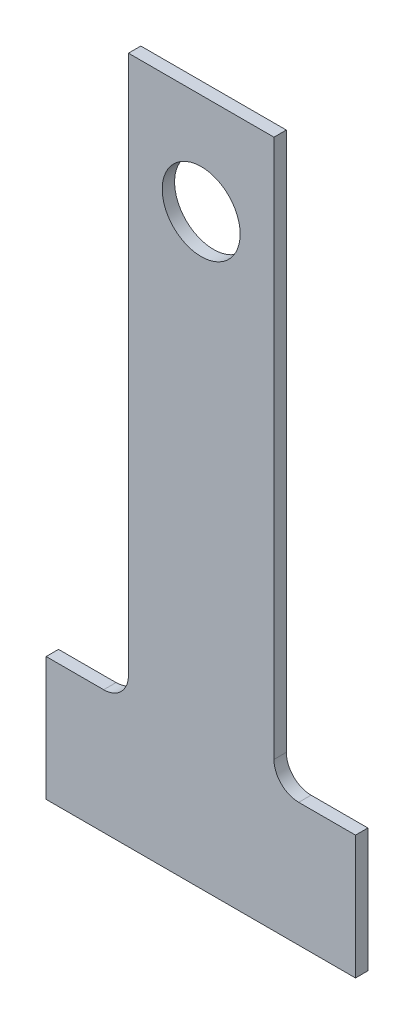
ISO-10303-21;
HEADER;
FILE_DESCRIPTION(('STEP AP214'),'2;1');
FILE_NAME('part.step','',(''),(''),'','','');
FILE_SCHEMA(('AUTOMOTIVE_DESIGN { 1 0 10303 214 1 1 1 1 }'));
ENDSEC;
DATA;
#1=APPLICATION_CONTEXT('core data for automotive mechanical design processes');
#2=APPLICATION_PROTOCOL_DEFINITION('international standard','automotive_design',2000,#1);
#3=PRODUCT_CONTEXT('',#1,'mechanical');
#4=PRODUCT('Part','Part','',(#3));
#5=PRODUCT_RELATED_PRODUCT_CATEGORY('part','',(#4));
#6=PRODUCT_DEFINITION_FORMATION('','',#4);
#7=PRODUCT_DEFINITION_CONTEXT('part definition',#1,'design');
#8=PRODUCT_DEFINITION('design','',#6,#7);
#9=PRODUCT_DEFINITION_SHAPE('','',#8);
#10=(LENGTH_UNIT() NAMED_UNIT(*) SI_UNIT(.MILLI.,.METRE.));
#11=(NAMED_UNIT(*) PLANE_ANGLE_UNIT() SI_UNIT($,.RADIAN.));
#12=(NAMED_UNIT(*) SI_UNIT($,.STERADIAN.) SOLID_ANGLE_UNIT());
#13=UNCERTAINTY_MEASURE_WITH_UNIT(LENGTH_MEASURE(1.E-05),#10,'distance_accuracy_value','');
#14=(GEOMETRIC_REPRESENTATION_CONTEXT(3) GLOBAL_UNCERTAINTY_ASSIGNED_CONTEXT((#13)) GLOBAL_UNIT_ASSIGNED_CONTEXT((#10,
#11,#12)) REPRESENTATION_CONTEXT('',''));
#15=CARTESIAN_POINT('',(0.,0.,0.));
#16=DIRECTION('',(0.,0.,1.));
#17=DIRECTION('',(1.,0.,0.));
#18=AXIS2_PLACEMENT_3D('',#15,#16,#17);
#19=CARTESIAN_POINT('',(-7.85000000000002,-6.,1.));
#20=DIRECTION('',(0.,-1.,0.));
#21=DIRECTION('',(0.,0.,-1.));
#22=AXIS2_PLACEMENT_3D('',#19,#20,#21);
#23=PLANE('',#22);
#24=DIRECTION('',(-1.,0.,0.));
#25=VECTOR('',#24,1.);
#26=CARTESIAN_POINT('',(-7.85000000000002,-6.,0.));
#27=LINE('',#26,#25);
#28=CARTESIAN_POINT('',(-7.85000000000002,-6.,0.));
#29=VERTEX_POINT('',#28);
#30=CARTESIAN_POINT('',(-12.5,-6.,0.));
#31=VERTEX_POINT('',#30);
#32=EDGE_CURVE('E143',#29,#31,#27,.T.);
#33=ORIENTED_EDGE('',*,*,#32,.T.);
#34=DIRECTION('',(0.,0.,-1.));
#35=VECTOR('',#34,1.);
#36=CARTESIAN_POINT('',(-12.5,-6.,1.));
#37=LINE('',#36,#35);
#38=CARTESIAN_POINT('',(-12.5,-6.,1.));
#39=VERTEX_POINT('',#38);
#40=EDGE_CURVE('E11',#39,#31,#37,.T.);
#41=ORIENTED_EDGE('',*,*,#40,.F.);
#42=DIRECTION('',(-1.,0.,0.));
#43=VECTOR('',#42,1.);
#44=CARTESIAN_POINT('',(-7.85000000000002,-6.,1.));
#45=LINE('',#44,#43);
#46=CARTESIAN_POINT('',(-7.85000000000002,-6.,1.));
#47=VERTEX_POINT('',#46);
#48=EDGE_CURVE('E163',#47,#39,#45,.T.);
#49=ORIENTED_EDGE('',*,*,#48,.F.);
#50=DIRECTION('',(0.,0.,-1.));
#51=VECTOR('',#50,1.);
#52=CARTESIAN_POINT('',(-7.85000000000002,-6.,1.));
#53=LINE('',#52,#51);
#54=EDGE_CURVE('E139',#47,#29,#53,.T.);
#55=ORIENTED_EDGE('',*,*,#54,.T.);
#56=EDGE_LOOP('',(#33,#41,#49,#55));
#57=FACE_BOUND('',#56,.T.);
#58=ADVANCED_FACE('F35',(#57),#23,.F.);
#59=CARTESIAN_POINT('',(-12.5,-6.,1.));
#60=DIRECTION('',(1.,0.,0.));
#61=DIRECTION('',(0.,0.,-1.));
#62=AXIS2_PLACEMENT_3D('',#59,#60,#61);
#63=PLANE('',#62);
#64=DIRECTION('',(0.,-1.,0.));
#65=VECTOR('',#64,1.);
#66=CARTESIAN_POINT('',(-12.5,-6.,0.));
#67=LINE('',#66,#65);
#68=CARTESIAN_POINT('',(-12.5,-16.,0.));
#69=VERTEX_POINT('',#68);
#70=EDGE_CURVE('E146',#31,#69,#67,.T.);
#71=ORIENTED_EDGE('',*,*,#70,.T.);
#72=DIRECTION('',(0.,0.,-1.));
#73=VECTOR('',#72,1.);
#74=CARTESIAN_POINT('',(-12.5,-16.,1.));
#75=LINE('',#74,#73);
#76=CARTESIAN_POINT('',(-12.5,-16.,1.));
#77=VERTEX_POINT('',#76);
#78=EDGE_CURVE('E43',#77,#69,#75,.T.);
#79=ORIENTED_EDGE('',*,*,#78,.F.);
#80=DIRECTION('',(0.,-1.,0.));
#81=VECTOR('',#80,1.);
#82=CARTESIAN_POINT('',(-12.5,-6.,1.));
#83=LINE('',#82,#81);
#84=EDGE_CURVE('E99',#39,#77,#83,.T.);
#85=ORIENTED_EDGE('',*,*,#84,.F.);
#86=ORIENTED_EDGE('',*,*,#40,.T.);
#87=EDGE_LOOP('',(#71,#79,#85,#86));
#88=FACE_BOUND('',#87,.T.);
#89=ADVANCED_FACE('F233',(#88),#63,.F.);
#90=CARTESIAN_POINT('',(-12.5,-16.,1.));
#91=DIRECTION('',(0.,1.,0.));
#92=DIRECTION('',(0.,0.,1.));
#93=AXIS2_PLACEMENT_3D('',#90,#91,#92);
#94=PLANE('',#93);
#95=DIRECTION('',(1.,0.,0.));
#96=VECTOR('',#95,1.);
#97=CARTESIAN_POINT('',(-12.5,-16.,0.));
#98=LINE('',#97,#96);
#99=CARTESIAN_POINT('',(12.5,-16.,0.));
#100=VERTEX_POINT('',#99);
#101=EDGE_CURVE('E149',#69,#100,#98,.T.);
#102=ORIENTED_EDGE('',*,*,#101,.T.);
#103=DIRECTION('',(0.,0.,-1.));
#104=VECTOR('',#103,1.);
#105=CARTESIAN_POINT('',(12.5,-16.,1.));
#106=LINE('',#105,#104);
#107=CARTESIAN_POINT('',(12.5,-16.,1.));
#108=VERTEX_POINT('',#107);
#109=EDGE_CURVE('E176',#108,#100,#106,.T.);
#110=ORIENTED_EDGE('',*,*,#109,.F.);
#111=DIRECTION('',(1.,0.,0.));
#112=VECTOR('',#111,1.);
#113=CARTESIAN_POINT('',(-12.5,-16.,1.));
#114=LINE('',#113,#112);
#115=EDGE_CURVE('E184',#77,#108,#114,.T.);
#116=ORIENTED_EDGE('',*,*,#115,.F.);
#117=ORIENTED_EDGE('',*,*,#78,.T.);
#118=EDGE_LOOP('',(#102,#110,#116,#117));
#119=FACE_BOUND('',#118,.T.);
#120=ADVANCED_FACE('F182',(#119),#94,.F.);
#121=CARTESIAN_POINT('',(12.5,-16.,1.));
#122=DIRECTION('',(-1.,0.,0.));
#123=DIRECTION('',(0.,0.,1.));
#124=AXIS2_PLACEMENT_3D('',#121,#122,#123);
#125=PLANE('',#124);
#126=DIRECTION('',(0.,1.,0.));
#127=VECTOR('',#126,1.);
#128=CARTESIAN_POINT('',(12.5,-16.,0.));
#129=LINE('',#128,#127);
#130=CARTESIAN_POINT('',(12.5,-6.,0.));
#131=VERTEX_POINT('',#130);
#132=EDGE_CURVE('E151',#100,#131,#129,.T.);
#133=ORIENTED_EDGE('',*,*,#132,.T.);
#134=DIRECTION('',(0.,0.,-1.));
#135=VECTOR('',#134,1.);
#136=CARTESIAN_POINT('',(12.5,-6.,1.));
#137=LINE('',#136,#135);
#138=CARTESIAN_POINT('',(12.5,-6.,1.));
#139=VERTEX_POINT('',#138);
#140=EDGE_CURVE('E173',#139,#131,#137,.T.);
#141=ORIENTED_EDGE('',*,*,#140,.F.);
#142=DIRECTION('',(0.,1.,0.));
#143=VECTOR('',#142,1.);
#144=CARTESIAN_POINT('',(12.5,-16.,1.));
#145=LINE('',#144,#143);
#146=EDGE_CURVE('E202',#108,#139,#145,.T.);
#147=ORIENTED_EDGE('',*,*,#146,.F.);
#148=ORIENTED_EDGE('',*,*,#109,.T.);
#149=EDGE_LOOP('',(#133,#141,#147,#148));
#150=FACE_BOUND('',#149,.T.);
#151=ADVANCED_FACE('F193',(#150),#125,.F.);
#152=CARTESIAN_POINT('',(7.91,-6.,1.));
#153=DIRECTION('',(0.,-1.,0.));
#154=DIRECTION('',(1.,0.,0.));
#155=AXIS2_PLACEMENT_3D('',#152,#153,#154);
#156=PLANE('',#155);
#157=DIRECTION('',(-1.,0.,0.));
#158=VECTOR('',#157,1.);
#159=CARTESIAN_POINT('',(7.91,-6.,0.));
#160=LINE('',#159,#158);
#161=CARTESIAN_POINT('',(7.91,-6.,0.));
#162=VERTEX_POINT('',#161);
#163=EDGE_CURVE('E153',#131,#162,#160,.T.);
#164=ORIENTED_EDGE('',*,*,#163,.T.);
#165=DIRECTION('',(0.,0.,-1.));
#166=VECTOR('',#165,1.);
#167=CARTESIAN_POINT('',(7.91,-6.,1.));
#168=LINE('',#167,#166);
#169=CARTESIAN_POINT('',(7.91,-6.,1.));
#170=VERTEX_POINT('',#169);
#171=EDGE_CURVE('E170',#170,#162,#168,.T.);
#172=ORIENTED_EDGE('',*,*,#171,.F.);
#173=DIRECTION('',(-1.,0.,0.));
#174=VECTOR('',#173,1.);
#175=CARTESIAN_POINT('',(7.91,-6.,1.));
#176=LINE('',#175,#174);
#177=EDGE_CURVE('E199',#139,#170,#176,.T.);
#178=ORIENTED_EDGE('',*,*,#177,.F.);
#179=ORIENTED_EDGE('',*,*,#140,.T.);
#180=EDGE_LOOP('',(#164,#172,#178,#179));
#181=FACE_BOUND('',#180,.T.);
#182=ADVANCED_FACE('F197',(#181),#156,.F.);
#183=CARTESIAN_POINT('',(7.91,-4.,1.));
#184=DIRECTION('',(0.,0.,-1.));
#185=DIRECTION('',(-1.,0.,0.));
#186=AXIS2_PLACEMENT_3D('',#183,#184,#185);
#187=CYLINDRICAL_SURFACE('',#186,2.);
#188=CARTESIAN_POINT('',(7.91,-4.,0.));
#189=DIRECTION('',(0.,0.,-1.));
#190=DIRECTION('',(1.,0.,0.));
#191=AXIS2_PLACEMENT_3D('',#188,#189,#190);
#192=CIRCLE('',#191,2.);
#193=CARTESIAN_POINT('',(5.91,-4.,0.));
#194=VERTEX_POINT('',#193);
#195=EDGE_CURVE('E155',#162,#194,#192,.T.);
#196=ORIENTED_EDGE('',*,*,#195,.T.);
#197=DIRECTION('',(0.,0.,-1.));
#198=VECTOR('',#197,1.);
#199=CARTESIAN_POINT('',(5.91,-4.,1.));
#200=LINE('',#199,#198);
#201=CARTESIAN_POINT('',(5.91,-4.,1.));
#202=VERTEX_POINT('',#201);
#203=EDGE_CURVE('E167',#202,#194,#200,.T.);
#204=ORIENTED_EDGE('',*,*,#203,.F.);
#205=CARTESIAN_POINT('',(7.91,-4.,1.));
#206=DIRECTION('',(0.,0.,-1.));
#207=DIRECTION('',(1.,0.,0.));
#208=AXIS2_PLACEMENT_3D('',#205,#206,#207);
#209=CIRCLE('',#208,2.);
#210=EDGE_CURVE('E201',#170,#202,#209,.T.);
#211=ORIENTED_EDGE('',*,*,#210,.F.);
#212=ORIENTED_EDGE('',*,*,#171,.T.);
#213=EDGE_LOOP('',(#196,#204,#211,#212));
#214=FACE_BOUND('',#213,.T.);
#215=ADVANCED_FACE('F243',(#214),#187,.F.);
#216=CARTESIAN_POINT('',(5.91,39.55,1.));
#217=DIRECTION('',(-1.,0.,0.));
#218=DIRECTION('',(0.,0.,1.));
#219=AXIS2_PLACEMENT_3D('',#216,#217,#218);
#220=PLANE('',#219);
#221=DIRECTION('',(0.,1.,0.));
#222=VECTOR('',#221,1.);
#223=CARTESIAN_POINT('',(5.91,39.55,0.));
#224=LINE('',#223,#222);
#225=CARTESIAN_POINT('',(5.91,39.55,0.));
#226=VERTEX_POINT('',#225);
#227=EDGE_CURVE('E158',#194,#226,#224,.T.);
#228=ORIENTED_EDGE('',*,*,#227,.T.);
#229=DIRECTION('',(0.,0.,-1.));
#230=VECTOR('',#229,1.);
#231=CARTESIAN_POINT('',(5.91,39.55,1.));
#232=LINE('',#231,#230);
#233=CARTESIAN_POINT('',(5.91,39.55,1.));
#234=VERTEX_POINT('',#233);
#235=EDGE_CURVE('E134',#234,#226,#232,.T.);
#236=ORIENTED_EDGE('',*,*,#235,.F.);
#237=DIRECTION('',(0.,1.,0.));
#238=VECTOR('',#237,1.);
#239=CARTESIAN_POINT('',(5.91,5.45,1.));
#240=LINE('',#239,#238);
#241=EDGE_CURVE('E124',#202,#234,#240,.T.);
#242=ORIENTED_EDGE('',*,*,#241,.F.);
#243=ORIENTED_EDGE('',*,*,#203,.T.);
#244=EDGE_LOOP('',(#228,#236,#242,#243));
#245=FACE_BOUND('',#244,.T.);
#246=ADVANCED_FACE('F244',(#245),#220,.F.);
#247=CARTESIAN_POINT('',(-5.85,39.55,1.));
#248=DIRECTION('',(0.,-1.,0.));
#249=DIRECTION('',(0.,0.,-1.));
#250=AXIS2_PLACEMENT_3D('',#247,#248,#249);
#251=PLANE('',#250);
#252=DIRECTION('',(-1.,0.,0.));
#253=VECTOR('',#252,1.);
#254=CARTESIAN_POINT('',(-5.85,39.55,0.));
#255=LINE('',#254,#253);
#256=CARTESIAN_POINT('',(-5.85,39.55,0.));
#257=VERTEX_POINT('',#256);
#258=EDGE_CURVE('E133',#226,#257,#255,.T.);
#259=ORIENTED_EDGE('',*,*,#258,.T.);
#260=DIRECTION('',(0.,0.,-1.));
#261=VECTOR('',#260,1.);
#262=CARTESIAN_POINT('',(-5.85,39.55,1.));
#263=LINE('',#262,#261);
#264=CARTESIAN_POINT('',(-5.85,39.55,1.));
#265=VERTEX_POINT('',#264);
#266=EDGE_CURVE('E130',#265,#257,#263,.T.);
#267=ORIENTED_EDGE('',*,*,#266,.F.);
#268=DIRECTION('',(-1.,0.,0.));
#269=VECTOR('',#268,1.);
#270=CARTESIAN_POINT('',(-5.85,39.55,1.));
#271=LINE('',#270,#269);
#272=EDGE_CURVE('E118',#234,#265,#271,.T.);
#273=ORIENTED_EDGE('',*,*,#272,.F.);
#274=ORIENTED_EDGE('',*,*,#235,.T.);
#275=EDGE_LOOP('',(#259,#267,#273,#274));
#276=FACE_BOUND('',#275,.T.);
#277=ADVANCED_FACE('F131',(#276),#251,.F.);
#278=CARTESIAN_POINT('',(-5.85,-3.99999999999998,1.));
#279=DIRECTION('',(1.,0.,0.));
#280=DIRECTION('',(0.,0.,-1.));
#281=AXIS2_PLACEMENT_3D('',#278,#279,#280);
#282=PLANE('',#281);
#283=DIRECTION('',(0.,-1.,0.));
#284=VECTOR('',#283,1.);
#285=CARTESIAN_POINT('',(-5.85,-3.99999999999998,0.));
#286=LINE('',#285,#284);
#287=CARTESIAN_POINT('',(-5.85,-3.99999999999998,0.));
#288=VERTEX_POINT('',#287);
#289=EDGE_CURVE('E85',#257,#288,#286,.T.);
#290=ORIENTED_EDGE('',*,*,#289,.T.);
#291=DIRECTION('',(0.,0.,-1.));
#292=VECTOR('',#291,1.);
#293=CARTESIAN_POINT('',(-5.85,-3.99999999999998,1.));
#294=LINE('',#293,#292);
#295=CARTESIAN_POINT('',(-5.85,-3.99999999999998,1.));
#296=VERTEX_POINT('',#295);
#297=EDGE_CURVE('E135',#296,#288,#294,.T.);
#298=ORIENTED_EDGE('',*,*,#297,.F.);
#299=DIRECTION('',(0.,-1.,0.));
#300=VECTOR('',#299,1.);
#301=CARTESIAN_POINT('',(-5.85,5.45,1.));
#302=LINE('',#301,#300);
#303=EDGE_CURVE('E122',#265,#296,#302,.T.);
#304=ORIENTED_EDGE('',*,*,#303,.F.);
#305=ORIENTED_EDGE('',*,*,#266,.T.);
#306=EDGE_LOOP('',(#290,#298,#304,#305));
#307=FACE_BOUND('',#306,.T.);
#308=ADVANCED_FACE('F137',(#307),#282,.F.);
#309=CARTESIAN_POINT('',(-7.85,-4.,1.));
#310=DIRECTION('',(0.,0.,-1.));
#311=DIRECTION('',(-1.,0.,0.));
#312=AXIS2_PLACEMENT_3D('',#309,#310,#311);
#313=CYLINDRICAL_SURFACE('',#312,2.);
#314=CARTESIAN_POINT('',(-7.85,-4.,0.));
#315=DIRECTION('',(0.,0.,-1.));
#316=DIRECTION('',(-1.,0.,0.));
#317=AXIS2_PLACEMENT_3D('',#314,#315,#316);
#318=CIRCLE('',#317,2.);
#319=EDGE_CURVE('E91',#288,#29,#318,.T.);
#320=ORIENTED_EDGE('',*,*,#319,.T.);
#321=ORIENTED_EDGE('',*,*,#54,.F.);
#322=CARTESIAN_POINT('',(-7.85,-4.,1.));
#323=DIRECTION('',(0.,0.,-1.));
#324=DIRECTION('',(-1.,0.,0.));
#325=AXIS2_PLACEMENT_3D('',#322,#323,#324);
#326=CIRCLE('',#325,2.);
#327=EDGE_CURVE('E51',#296,#47,#326,.T.);
#328=ORIENTED_EDGE('',*,*,#327,.F.);
#329=ORIENTED_EDGE('',*,*,#297,.T.);
#330=EDGE_LOOP('',(#320,#321,#328,#329));
#331=FACE_BOUND('',#330,.T.);
#332=ADVANCED_FACE('F224',(#331),#313,.F.);
#333=CARTESIAN_POINT('',(7.91,-4.,1.));
#334=DIRECTION('',(0.,0.,1.));
#335=DIRECTION('',(1.,0.,0.));
#336=AXIS2_PLACEMENT_3D('',#333,#334,#335);
#337=PLANE('',#336);
#338=CARTESIAN_POINT('',(0.0300000000000005,31.4,1.));
#339=DIRECTION('',(0.,0.,1.));
#340=DIRECTION('',(1.,0.,0.));
#341=AXIS2_PLACEMENT_3D('',#338,#339,#340);
#342=CIRCLE('',#341,3.15);
#343=CARTESIAN_POINT('',(3.18,31.4,1.));
#344=VERTEX_POINT('',#343);
#345=EDGE_CURVE('E210',#344,#344,#342,.T.);
#346=ORIENTED_EDGE('',*,*,#345,.F.);
#347=EDGE_LOOP('',(#346));
#348=FACE_BOUND('',#347,.T.);
#349=ORIENTED_EDGE('',*,*,#48,.T.);
#350=ORIENTED_EDGE('',*,*,#84,.T.);
#351=ORIENTED_EDGE('',*,*,#115,.T.);
#352=ORIENTED_EDGE('',*,*,#146,.T.);
#353=ORIENTED_EDGE('',*,*,#177,.T.);
#354=ORIENTED_EDGE('',*,*,#210,.T.);
#355=ORIENTED_EDGE('',*,*,#241,.T.);
#356=ORIENTED_EDGE('',*,*,#272,.T.);
#357=ORIENTED_EDGE('',*,*,#303,.T.);
#358=ORIENTED_EDGE('',*,*,#327,.T.);
#359=EDGE_LOOP('',(#349,#350,#351,#352,#353,#354,#355,#356,#357,#358));
#360=FACE_BOUND('',#359,.T.);
#361=ADVANCED_FACE('F120',(#348,#360),#337,.T.);
#362=CARTESIAN_POINT('',(7.91,-4.,0.));
#363=DIRECTION('',(0.,0.,1.));
#364=DIRECTION('',(1.,0.,0.));
#365=AXIS2_PLACEMENT_3D('',#362,#363,#364);
#366=PLANE('',#365);
#367=CARTESIAN_POINT('',(0.0300000000000005,31.4,0.));
#368=DIRECTION('',(0.,0.,1.));
#369=DIRECTION('',(1.,0.,0.));
#370=AXIS2_PLACEMENT_3D('',#367,#368,#369);
#371=CIRCLE('',#370,3.15);
#372=CARTESIAN_POINT('',(3.18,31.4,0.));
#373=VERTEX_POINT('',#372);
#374=EDGE_CURVE('E147',#373,#373,#371,.T.);
#375=ORIENTED_EDGE('',*,*,#374,.T.);
#376=EDGE_LOOP('',(#375));
#377=FACE_BOUND('',#376,.T.);
#378=ORIENTED_EDGE('',*,*,#32,.F.);
#379=ORIENTED_EDGE('',*,*,#319,.F.);
#380=ORIENTED_EDGE('',*,*,#289,.F.);
#381=ORIENTED_EDGE('',*,*,#258,.F.);
#382=ORIENTED_EDGE('',*,*,#227,.F.);
#383=ORIENTED_EDGE('',*,*,#195,.F.);
#384=ORIENTED_EDGE('',*,*,#163,.F.);
#385=ORIENTED_EDGE('',*,*,#132,.F.);
#386=ORIENTED_EDGE('',*,*,#101,.F.);
#387=ORIENTED_EDGE('',*,*,#70,.F.);
#388=EDGE_LOOP('',(#378,#379,#380,#381,#382,#383,#384,#385,#386,#387));
#389=FACE_BOUND('',#388,.T.);
#390=ADVANCED_FACE('F188',(#377,#389),#366,.F.);
#391=CARTESIAN_POINT('',(0.0300000000000005,31.4,0.));
#392=DIRECTION('',(0.,0.,1.));
#393=DIRECTION('',(1.,0.,0.));
#394=AXIS2_PLACEMENT_3D('',#391,#392,#393);
#395=CYLINDRICAL_SURFACE('',#394,3.15);
#396=ORIENTED_EDGE('',*,*,#374,.F.);
#397=EDGE_LOOP('',(#396));
#398=FACE_BOUND('',#397,.T.);
#399=ORIENTED_EDGE('',*,*,#345,.T.);
#400=EDGE_LOOP('',(#399));
#401=FACE_BOUND('',#400,.T.);
#402=ADVANCED_FACE('F217',(#398,#401),#395,.F.);
#403=CLOSED_SHELL('',(#58,#89,#120,#151,#182,#215,#246,#277,#308,#332,#361,#390,#402));
#404=MANIFOLD_SOLID_BREP('B2',#403);
#405=ADVANCED_BREP_SHAPE_REPRESENTATION('',(#18,#404),#14);
#406=SHAPE_DEFINITION_REPRESENTATION(#9,#405);
ENDSEC;
END-ISO-10303-21;
